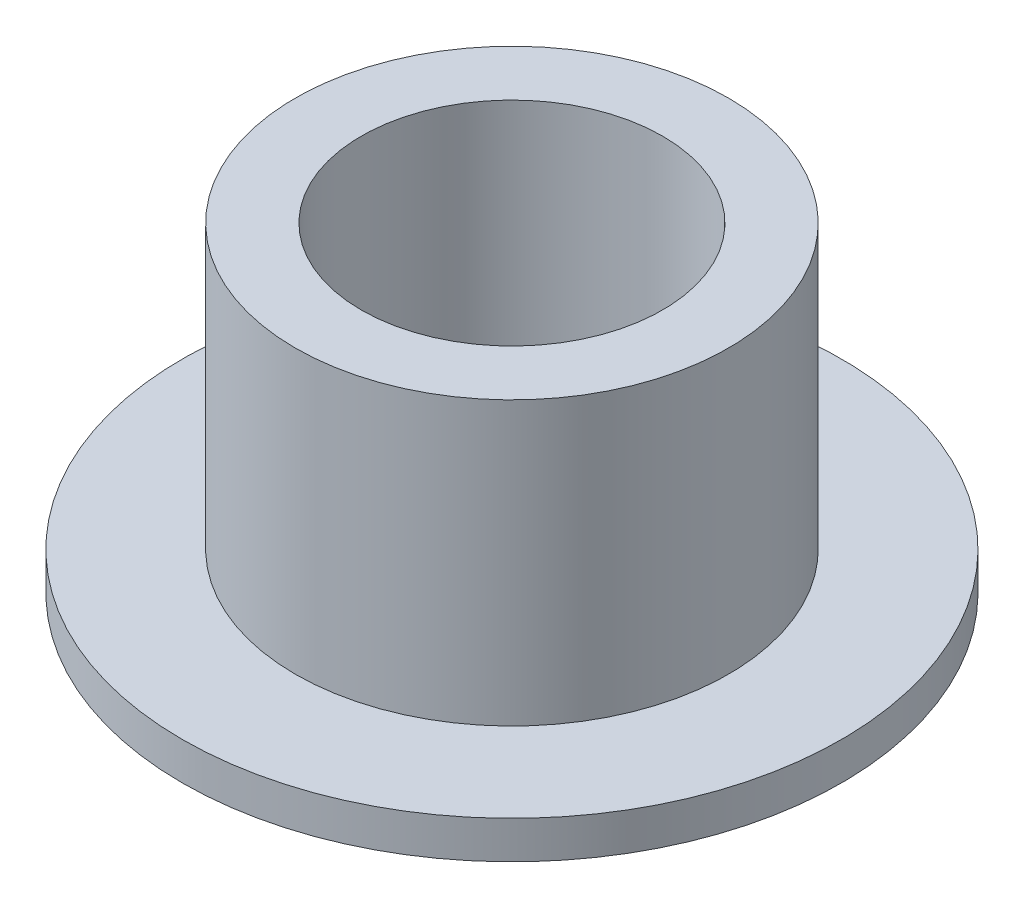
ISO-10303-21;
HEADER;
FILE_DESCRIPTION(('STEP AP214'),'2;1');
FILE_NAME('part.step','',(''),(''),'','','');
FILE_SCHEMA(('AUTOMOTIVE_DESIGN { 1 0 10303 214 1 1 1 1 }'));
ENDSEC;
DATA;
#1=APPLICATION_CONTEXT('core data for automotive mechanical design processes');
#2=APPLICATION_PROTOCOL_DEFINITION('international standard','automotive_design',2000,#1);
#3=PRODUCT_CONTEXT('',#1,'mechanical');
#4=PRODUCT('Part','Part','',(#3));
#5=PRODUCT_RELATED_PRODUCT_CATEGORY('part','',(#4));
#6=PRODUCT_DEFINITION_FORMATION('','',#4);
#7=PRODUCT_DEFINITION_CONTEXT('part definition',#1,'design');
#8=PRODUCT_DEFINITION('design','',#6,#7);
#9=PRODUCT_DEFINITION_SHAPE('','',#8);
#10=(LENGTH_UNIT() NAMED_UNIT(*) SI_UNIT(.MILLI.,.METRE.));
#11=(NAMED_UNIT(*) PLANE_ANGLE_UNIT() SI_UNIT($,.RADIAN.));
#12=(NAMED_UNIT(*) SI_UNIT($,.STERADIAN.) SOLID_ANGLE_UNIT());
#13=UNCERTAINTY_MEASURE_WITH_UNIT(LENGTH_MEASURE(1.E-05),#10,'distance_accuracy_value','');
#14=(GEOMETRIC_REPRESENTATION_CONTEXT(3) GLOBAL_UNCERTAINTY_ASSIGNED_CONTEXT((#13)) GLOBAL_UNIT_ASSIGNED_CONTEXT((#10,
#11,#12)) REPRESENTATION_CONTEXT('',''));
#15=CARTESIAN_POINT('',(0.,0.,0.));
#16=DIRECTION('',(0.,0.,1.));
#17=DIRECTION('',(1.,0.,0.));
#18=AXIS2_PLACEMENT_3D('',#15,#16,#17);
#19=CARTESIAN_POINT('',(0.,0.4,0.));
#20=DIRECTION('',(0.,-1.,0.));
#21=DIRECTION('',(0.,0.,-1.));
#22=AXIS2_PLACEMENT_3D('',#19,#20,#21);
#23=CYLINDRICAL_SURFACE('',#22,3.5);
#24=CARTESIAN_POINT('',(0.,0.4,0.));
#25=DIRECTION('',(0.,1.,0.));
#26=DIRECTION('',(0.,0.,1.));
#27=AXIS2_PLACEMENT_3D('',#24,#25,#26);
#28=CIRCLE('',#27,3.5);
#29=CARTESIAN_POINT('',(0.,0.4,3.5));
#30=VERTEX_POINT('',#29);
#31=EDGE_CURVE('E42',#30,#30,#28,.T.);
#32=ORIENTED_EDGE('',*,*,#31,.F.);
#33=EDGE_LOOP('',(#32));
#34=FACE_BOUND('',#33,.T.);
#35=CARTESIAN_POINT('',(0.,0.,0.));
#36=DIRECTION('',(0.,1.,0.));
#37=DIRECTION('',(0.,0.,1.));
#38=AXIS2_PLACEMENT_3D('',#35,#36,#37);
#39=CIRCLE('',#38,3.5);
#40=CARTESIAN_POINT('',(0.,0.,3.5));
#41=VERTEX_POINT('',#40);
#42=EDGE_CURVE('E38',#41,#41,#39,.T.);
#43=ORIENTED_EDGE('',*,*,#42,.T.);
#44=EDGE_LOOP('',(#43));
#45=FACE_BOUND('',#44,.T.);
#46=ADVANCED_FACE('F35',(#34,#45),#23,.T.);
#47=CARTESIAN_POINT('',(0.,0.4,0.));
#48=DIRECTION('',(0.,1.,0.));
#49=DIRECTION('',(0.,0.,1.));
#50=AXIS2_PLACEMENT_3D('',#47,#48,#49);
#51=PLANE('',#50);
#52=CARTESIAN_POINT('',(0.,0.4,0.));
#53=DIRECTION('',(0.,1.,0.));
#54=DIRECTION('',(0.,0.,1.));
#55=AXIS2_PLACEMENT_3D('',#52,#53,#54);
#56=CIRCLE('',#55,2.3);
#57=CARTESIAN_POINT('',(0.,0.4,2.3));
#58=VERTEX_POINT('',#57);
#59=EDGE_CURVE('E10',#58,#58,#56,.T.);
#60=ORIENTED_EDGE('',*,*,#59,.F.);
#61=EDGE_LOOP('',(#60));
#62=FACE_BOUND('',#61,.T.);
#63=ORIENTED_EDGE('',*,*,#31,.T.);
#64=EDGE_LOOP('',(#63));
#65=FACE_BOUND('',#64,.T.);
#66=ADVANCED_FACE('F74',(#62,#65),#51,.T.);
#67=CARTESIAN_POINT('',(0.,0.,0.));
#68=DIRECTION('',(0.,1.,0.));
#69=DIRECTION('',(0.,0.,1.));
#70=AXIS2_PLACEMENT_3D('',#67,#68,#69);
#71=PLANE('',#70);
#72=CARTESIAN_POINT('',(0.,0.,0.));
#73=DIRECTION('',(0.,1.,0.));
#74=DIRECTION('',(0.,0.,1.));
#75=AXIS2_PLACEMENT_3D('',#72,#73,#74);
#76=CIRCLE('',#75,1.6);
#77=CARTESIAN_POINT('',(0.,0.,1.6));
#78=VERTEX_POINT('',#77);
#79=EDGE_CURVE('E51',#78,#78,#76,.T.);
#80=ORIENTED_EDGE('',*,*,#79,.T.);
#81=EDGE_LOOP('',(#80));
#82=FACE_BOUND('',#81,.T.);
#83=ORIENTED_EDGE('',*,*,#42,.F.);
#84=EDGE_LOOP('',(#83));
#85=FACE_BOUND('',#84,.T.);
#86=ADVANCED_FACE('F69',(#82,#85),#71,.F.);
#87=CARTESIAN_POINT('',(0.,3.4,0.));
#88=DIRECTION('',(0.,-1.,0.));
#89=DIRECTION('',(0.,0.,-1.));
#90=AXIS2_PLACEMENT_3D('',#87,#88,#89);
#91=CYLINDRICAL_SURFACE('',#90,2.3);
#92=CARTESIAN_POINT('',(0.,3.4,0.));
#93=DIRECTION('',(0.,1.,0.));
#94=DIRECTION('',(0.,0.,1.));
#95=AXIS2_PLACEMENT_3D('',#92,#93,#94);
#96=CIRCLE('',#95,2.3);
#97=CARTESIAN_POINT('',(0.,3.4,2.3));
#98=VERTEX_POINT('',#97);
#99=EDGE_CURVE('E48',#98,#98,#96,.T.);
#100=ORIENTED_EDGE('',*,*,#99,.F.);
#101=EDGE_LOOP('',(#100));
#102=FACE_BOUND('',#101,.T.);
#103=ORIENTED_EDGE('',*,*,#59,.T.);
#104=EDGE_LOOP('',(#103));
#105=FACE_BOUND('',#104,.T.);
#106=ADVANCED_FACE('F64',(#102,#105),#91,.T.);
#107=CARTESIAN_POINT('',(0.,3.4,0.));
#108=DIRECTION('',(0.,1.,0.));
#109=DIRECTION('',(0.,0.,1.));
#110=AXIS2_PLACEMENT_3D('',#107,#108,#109);
#111=PLANE('',#110);
#112=CARTESIAN_POINT('',(0.,3.4,0.));
#113=DIRECTION('',(0.,1.,0.));
#114=DIRECTION('',(0.,0.,1.));
#115=AXIS2_PLACEMENT_3D('',#112,#113,#114);
#116=CIRCLE('',#115,1.6);
#117=CARTESIAN_POINT('',(0.,3.4,1.6));
#118=VERTEX_POINT('',#117);
#119=EDGE_CURVE('E54',#118,#118,#116,.T.);
#120=ORIENTED_EDGE('',*,*,#119,.F.);
#121=EDGE_LOOP('',(#120));
#122=FACE_BOUND('',#121,.T.);
#123=ORIENTED_EDGE('',*,*,#99,.T.);
#124=EDGE_LOOP('',(#123));
#125=FACE_BOUND('',#124,.T.);
#126=ADVANCED_FACE('F61',(#122,#125),#111,.T.);
#127=CARTESIAN_POINT('',(0.,-12.6,0.));
#128=DIRECTION('',(0.,1.,0.));
#129=DIRECTION('',(0.,0.,1.));
#130=AXIS2_PLACEMENT_3D('',#127,#128,#129);
#131=CYLINDRICAL_SURFACE('',#130,1.6);
#132=ORIENTED_EDGE('',*,*,#119,.T.);
#133=EDGE_LOOP('',(#132));
#134=FACE_BOUND('',#133,.T.);
#135=ORIENTED_EDGE('',*,*,#79,.F.);
#136=EDGE_LOOP('',(#135));
#137=FACE_BOUND('',#136,.T.);
#138=ADVANCED_FACE('F58',(#134,#137),#131,.F.);
#139=CLOSED_SHELL('',(#46,#66,#86,#106,#126,#138));
#140=MANIFOLD_SOLID_BREP('B2',#139);
#141=ADVANCED_BREP_SHAPE_REPRESENTATION('',(#18,#140),#14);
#142=SHAPE_DEFINITION_REPRESENTATION(#9,#141);
ENDSEC;
END-ISO-10303-21;
